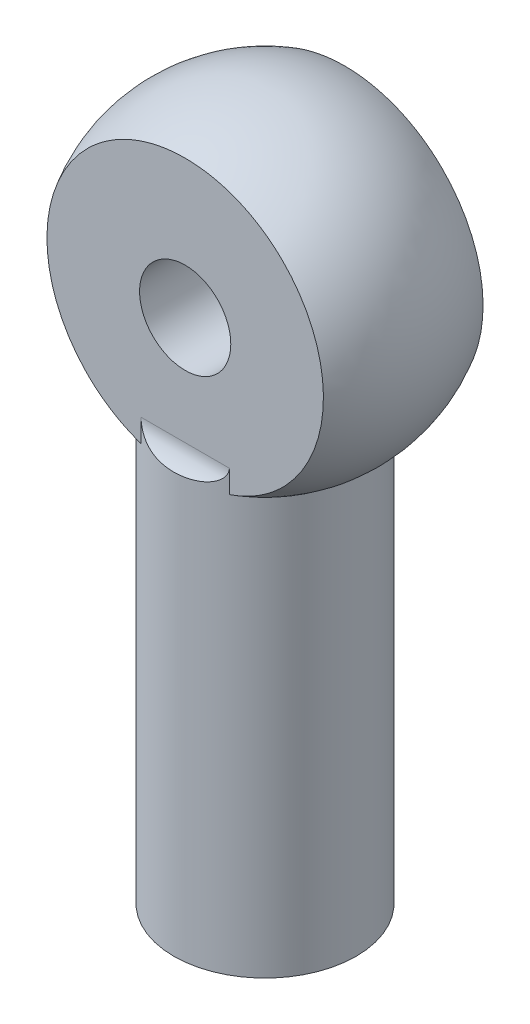
ISO-10303-21;
HEADER;
FILE_DESCRIPTION(('STEP AP214'),'2;1');
FILE_NAME('part.step','',(''),(''),'','','');
FILE_SCHEMA(('AUTOMOTIVE_DESIGN { 1 0 10303 214 1 1 1 1 }'));
ENDSEC;
DATA;
#1=APPLICATION_CONTEXT('core data for automotive mechanical design processes');
#2=APPLICATION_PROTOCOL_DEFINITION('international standard','automotive_design',2000,#1);
#3=PRODUCT_CONTEXT('',#1,'mechanical');
#4=PRODUCT('Part','Part','',(#3));
#5=PRODUCT_RELATED_PRODUCT_CATEGORY('part','',(#4));
#6=PRODUCT_DEFINITION_FORMATION('','',#4);
#7=PRODUCT_DEFINITION_CONTEXT('part definition',#1,'design');
#8=PRODUCT_DEFINITION('design','',#6,#7);
#9=PRODUCT_DEFINITION_SHAPE('','',#8);
#10=(LENGTH_UNIT() NAMED_UNIT(*) SI_UNIT(.MILLI.,.METRE.));
#11=(NAMED_UNIT(*) PLANE_ANGLE_UNIT() SI_UNIT($,.RADIAN.));
#12=(NAMED_UNIT(*) SI_UNIT($,.STERADIAN.) SOLID_ANGLE_UNIT());
#13=UNCERTAINTY_MEASURE_WITH_UNIT(LENGTH_MEASURE(1.E-05),#10,'distance_accuracy_value','');
#14=(GEOMETRIC_REPRESENTATION_CONTEXT(3) GLOBAL_UNCERTAINTY_ASSIGNED_CONTEXT((#13)) GLOBAL_UNIT_ASSIGNED_CONTEXT((#10,
#11,#12)) REPRESENTATION_CONTEXT('',''));
#15=CARTESIAN_POINT('',(0.,0.,0.));
#16=DIRECTION('',(0.,0.,1.));
#17=DIRECTION('',(1.,0.,0.));
#18=AXIS2_PLACEMENT_3D('',#15,#16,#17);
#19=CARTESIAN_POINT('',(4.,7.,0.));
#20=DIRECTION('',(0.,1.,0.));
#21=DIRECTION('',(1.,0.,0.));
#22=AXIS2_PLACEMENT_3D('',#19,#20,#21);
#23=SPHERICAL_SURFACE('',#22,7.);
#24=CARTESIAN_POINT('',(4.,1.25543735346197,0.));
#25=DIRECTION('',(0.,1.,0.));
#26=DIRECTION('',(-1.,0.,0.));
#27=AXIS2_PLACEMENT_3D('',#24,#25,#26);
#28=CIRCLE('',#27,4.);
#29=CARTESIAN_POINT('',(5.93649167310371,1.25543735346197,3.5));
#30=VERTEX_POINT('',#29);
#31=CARTESIAN_POINT('',(5.93649167310371,1.25543735346197,-3.5));
#32=VERTEX_POINT('',#31);
#33=EDGE_CURVE('E85',#30,#32,#28,.T.);
#34=ORIENTED_EDGE('',*,*,#33,.T.);
#35=CARTESIAN_POINT('',(4.,7.,-3.5));
#36=DIRECTION('',(0.,0.,1.));
#37=DIRECTION('',(0.,-1.,0.));
#38=AXIS2_PLACEMENT_3D('',#35,#36,#37);
#39=CIRCLE('',#38,6.06217782649107);
#40=CARTESIAN_POINT('',(2.0635083268963,1.25543735346198,-3.5));
#41=VERTEX_POINT('',#40);
#42=EDGE_CURVE('E88',#32,#41,#39,.T.);
#43=ORIENTED_EDGE('',*,*,#42,.T.);
#44=CARTESIAN_POINT('',(2.06350832689629,1.25543735346197,3.5));
#45=VERTEX_POINT('',#44);
#46=EDGE_CURVE('E87',#41,#45,#28,.T.);
#47=ORIENTED_EDGE('',*,*,#46,.T.);
#48=CARTESIAN_POINT('',(4.,7.,3.5));
#49=DIRECTION('',(0.,0.,1.));
#50=DIRECTION('',(1.,0.,0.));
#51=AXIS2_PLACEMENT_3D('',#48,#49,#50);
#52=CIRCLE('',#51,6.06217782649107);
#53=EDGE_CURVE('E76',#30,#45,#52,.T.);
#54=ORIENTED_EDGE('',*,*,#53,.F.);
#55=EDGE_LOOP('',(#34,#43,#47,#54));
#56=FACE_BOUND('',#55,.T.);
#57=ADVANCED_FACE('F34',(#56),#23,.T.);
#58=CARTESIAN_POINT('',(4.,-17.,0.));
#59=DIRECTION('',(0.,1.,0.));
#60=DIRECTION('',(-1.,0.,0.));
#61=AXIS2_PLACEMENT_3D('',#58,#59,#60);
#62=PLANE('',#61);
#63=CARTESIAN_POINT('',(4.,-17.,0.));
#64=DIRECTION('',(0.,-1.,0.));
#65=DIRECTION('',(1.,0.,0.));
#66=AXIS2_PLACEMENT_3D('',#63,#64,#65);
#67=CIRCLE('',#66,2.);
#68=CARTESIAN_POINT('',(6.,-17.,0.));
#69=VERTEX_POINT('',#68);
#70=EDGE_CURVE('E98',#69,#69,#67,.T.);
#71=ORIENTED_EDGE('',*,*,#70,.F.);
#72=EDGE_LOOP('',(#71));
#73=FACE_BOUND('',#72,.T.);
#74=CARTESIAN_POINT('',(4.,-17.,0.));
#75=DIRECTION('',(0.,1.,0.));
#76=DIRECTION('',(-1.,0.,0.));
#77=AXIS2_PLACEMENT_3D('',#74,#75,#76);
#78=CIRCLE('',#77,4.);
#79=CARTESIAN_POINT('',(0.,-17.,0.));
#80=VERTEX_POINT('',#79);
#81=EDGE_CURVE('E89',#80,#80,#78,.T.);
#82=ORIENTED_EDGE('',*,*,#81,.F.);
#83=EDGE_LOOP('',(#82));
#84=FACE_BOUND('',#83,.T.);
#85=ADVANCED_FACE('F123',(#73,#84),#62,.F.);
#86=CARTESIAN_POINT('',(4.,14.,0.));
#87=DIRECTION('',(0.,1.,0.));
#88=DIRECTION('',(-1.,0.,0.));
#89=AXIS2_PLACEMENT_3D('',#86,#87,#88);
#90=CYLINDRICAL_SURFACE('',#89,4.);
#91=DIRECTION('',(0.,1.,0.));
#92=VECTOR('',#91,1.);
#93=CARTESIAN_POINT('',(5.93649167310371,2.25543735346197,3.5));
#94=LINE('',#93,#92);
#95=CARTESIAN_POINT('',(5.93649167310371,2.25543735346197,3.5));
#96=VERTEX_POINT('',#95);
#97=EDGE_CURVE('E72',#96,#30,#94,.F.);
#98=ORIENTED_EDGE('',*,*,#97,.F.);
#99=CARTESIAN_POINT('',(5.93649167310371,2.25543735346197,3.5));
#100=CARTESIAN_POINT('',(5.93654092379007,2.22673001978082,3.49996308809474));
#101=CARTESIAN_POINT('',(5.93426114811949,2.19808384631559,3.50123433941194));
#102=CARTESIAN_POINT('',(5.92546769204043,2.14186620515227,3.50608276605149));
#103=CARTESIAN_POINT('',(5.91898659720174,2.11428818304731,3.50964219245945));
#104=CARTESIAN_POINT('',(5.90222270849331,2.0607588862967,3.51875445780161));
#105=CARTESIAN_POINT('',(5.89194876163645,2.03480398908894,3.52430265695858));
#106=CARTESIAN_POINT('',(5.86815826211663,1.98480421090087,3.53697167408665));
#107=CARTESIAN_POINT('',(5.85463532556468,1.96076321589978,3.54409558593575));
#108=CARTESIAN_POINT('',(5.81663133467395,1.9020025250381,3.56377905007528));
#109=CARTESIAN_POINT('',(5.79024149415002,1.8687911649137,3.57715642812788));
#110=CARTESIAN_POINT('',(5.73279368401518,1.80741429787041,3.60533778925412));
#111=CARTESIAN_POINT('',(5.70172476702678,1.77926097298326,3.62014508788618));
#112=CARTESIAN_POINT('',(5.61622773237972,1.71163820122258,3.65939143793828));
#113=CARTESIAN_POINT('',(5.55913223508577,1.67577496301329,3.68418390004483));
#114=CARTESIAN_POINT('',(5.43968204801416,1.61317848805314,3.73249413842498));
#115=CARTESIAN_POINT('',(5.37731367454452,1.58646997566955,3.75600832071588));
#116=CARTESIAN_POINT('',(5.25500425778152,1.54214967813796,3.79852268354728));
#117=CARTESIAN_POINT('',(5.19535091383807,1.52393505179368,3.81773869025047));
#118=CARTESIAN_POINT('',(5.07406637120553,1.49204419010563,3.85362006788863));
#119=CARTESIAN_POINT('',(5.01243354790921,1.47837179276231,3.87028327543827));
#120=CARTESIAN_POINT('',(4.88779050244931,1.45463381335752,3.90076225002791));
#121=CARTESIAN_POINT('',(4.82478009919624,1.44456870855361,3.91457764018896));
#122=CARTESIAN_POINT('',(4.69777596569175,1.42735075988373,3.93919998787572));
#123=CARTESIAN_POINT('',(4.6337819794512,1.42019868795892,3.95000614772871));
#124=CARTESIAN_POINT('',(4.47547703912614,1.40555707856756,3.97277351243643));
#125=CARTESIAN_POINT('',(4.3807818529349,1.39943015112528,3.9829731683636));
#126=CARTESIAN_POINT('',(4.19072321561555,1.39135655252623,3.99658709268504));
#127=CARTESIAN_POINT('',(4.09535962247608,1.38941079849438,3.99999987239088));
#128=CARTESIAN_POINT('',(3.91527865229126,1.38941297243523,4.0000001133731));
#129=CARTESIAN_POINT('',(3.83056043873222,1.39095073900751,3.99730653012422));
#130=CARTESIAN_POINT('',(3.66153763197775,1.39729184526725,3.98655441745223));
#131=CARTESIAN_POINT('',(3.57723327061694,1.40209684250715,3.97849316491176));
#132=CARTESIAN_POINT('',(3.40973059172965,1.41554012574654,3.95710749292122));
#133=CARTESIAN_POINT('',(3.32653074931901,1.42417239902565,3.94379133262029));
#134=CARTESIAN_POINT('',(3.161798682963,1.44627868991873,3.91208876559383));
#135=CARTESIAN_POINT('',(3.08026503068009,1.45974835937502,3.89370691567165));
#136=CARTESIAN_POINT('',(2.93930758811119,1.48904646299409,3.85731321684881));
#137=CARTESIAN_POINT('',(2.87934052710437,1.50349876881357,3.84030417892088));
#138=CARTESIAN_POINT('',(2.76140894720826,1.53705904015779,3.80390519518789));
#139=CARTESIAN_POINT('',(2.70344497715103,1.55616827027673,3.78451460337923));
#140=CARTESIAN_POINT('',(2.5900388104125,1.60045555804175,3.74375014780507));
#141=CARTESIAN_POINT('',(2.53461747443718,1.62567580024717,3.72236316285548));
#142=CARTESIAN_POINT('',(2.42826260119203,1.68376767247518,3.67871126447472));
#143=CARTESIAN_POINT('',(2.37732092406123,1.71662501207934,3.65644805446846));
#144=CARTESIAN_POINT('',(2.30104006406909,1.77714671499841,3.62140279755807));
#145=CARTESIAN_POINT('',(2.27347779915933,1.80181902004701,3.60831694728654));
#146=CARTESIAN_POINT('',(2.22186020332497,1.85509709205193,3.5831602513739));
#147=CARTESIAN_POINT('',(2.19780271851163,1.88370042198139,3.57108878428311));
#148=CARTESIAN_POINT('',(2.15766378618163,1.94037658173571,3.55052533930886));
#149=CARTESIAN_POINT('',(2.14092703159089,1.96788332492963,3.54176805772725));
#150=CARTESIAN_POINT('',(2.11178441813949,2.02558897108805,3.52631715158167));
#151=CARTESIAN_POINT('',(2.09936634711768,2.05577997457508,3.519617714324));
#152=CARTESIAN_POINT('',(2.08111265722014,2.11389122725749,3.50969659549748));
#153=CARTESIAN_POINT('',(2.07459727922606,2.14153441808977,3.50611850665981));
#154=CARTESIAN_POINT('',(2.06575369609603,2.19790383777853,3.50124256030533));
#155=CARTESIAN_POINT('',(2.06346038080216,2.22663710594455,3.49996370496699));
#156=CARTESIAN_POINT('',(2.06350832689629,2.25543735346197,3.5));
#157=B_SPLINE_CURVE_WITH_KNOTS('',3,(#99,#100,#101,#102,#103,#104,#105,#106,#107,#108,#109,#110,
#111,#112,#113,#114,#115,#116,#117,#118,#119,#120,#121,#122,#123,#124,#125,#126,#127,#128,#129,
#130,#131,#132,#133,#134,#135,#136,#137,#138,#139,#140,#141,#142,#143,#144,#145,#146,#147,#148,
#149,#150,#151,#152,#153,#154,#155,#156),.UNSPECIFIED.,.F.,.F.,(4,2,2,2,2,2,2,2,2,2,2,2,2,2,2,2,
2,2,2,2,2,2,2,2,2,2,2,2,4),(0.,0.0859063606141315,0.171154274167816,0.256204586377355,
0.341423399340485,0.474096797302446,0.607085569879978,0.821388813207654,1.03626635196854,
1.23178111482224,1.42746066207251,1.62316608886924,1.8189233430716,2.10486886159701,
2.39087709481414,2.64497838364879,2.89920868105781,3.15304098550821,3.4066456981508,
3.59840892986249,3.7902242932823,3.98340350388424,4.17622410988011,4.29365892210202,
4.41102125665095,4.51074884817048,4.61019209708668,4.69566162684801,4.78183433407867),.UNSPECIFIED.);
#158=CARTESIAN_POINT('',(2.06350832689629,2.25543735346197,3.5));
#159=VERTEX_POINT('',#158);
#160=EDGE_CURVE('E80',#96,#159,#157,.T.);
#161=ORIENTED_EDGE('',*,*,#160,.T.);
#162=DIRECTION('',(0.,1.,0.));
#163=VECTOR('',#162,1.);
#164=CARTESIAN_POINT('',(2.06350832689629,1.25543735346197,3.5));
#165=LINE('',#164,#163);
#166=EDGE_CURVE('E102',#45,#159,#165,.T.);
#167=ORIENTED_EDGE('',*,*,#166,.F.);
#168=ORIENTED_EDGE('',*,*,#46,.F.);
#169=DIRECTION('',(0.,1.,0.));
#170=VECTOR('',#169,1.);
#171=CARTESIAN_POINT('',(2.06350832689629,2.25543735346198,-3.5));
#172=LINE('',#171,#170);
#173=CARTESIAN_POINT('',(2.06350832689629,2.25543735346198,-3.5));
#174=VERTEX_POINT('',#173);
#175=EDGE_CURVE('E111',#174,#41,#172,.F.);
#176=ORIENTED_EDGE('',*,*,#175,.F.);
#177=CARTESIAN_POINT('',(2.06350832689629,2.25543735346198,-3.5));
#178=CARTESIAN_POINT('',(2.06345907620994,2.22673001978083,-3.49996308809474));
#179=CARTESIAN_POINT('',(2.06573885188052,2.19808384631559,-3.50123433941195));
#180=CARTESIAN_POINT('',(2.07453230795957,2.14186620515228,-3.50608276605149));
#181=CARTESIAN_POINT('',(2.08101340279827,2.11428818304732,-3.50964219245946));
#182=CARTESIAN_POINT('',(2.09777729150669,2.06075888629671,-3.51875445780161));
#183=CARTESIAN_POINT('',(2.10805123836355,2.03480398908895,-3.52430265695858));
#184=CARTESIAN_POINT('',(2.13184173788338,1.98480421090088,-3.53697167408666));
#185=CARTESIAN_POINT('',(2.14536467443532,1.96076321589978,-3.54409558593576));
#186=CARTESIAN_POINT('',(2.18336866532606,1.90200252503811,-3.56377905007528));
#187=CARTESIAN_POINT('',(2.20975850584999,1.86879116491371,-3.57715642812788));
#188=CARTESIAN_POINT('',(2.26720631598483,1.80741429787042,-3.60533778925412));
#189=CARTESIAN_POINT('',(2.29827523297322,1.77926097298327,-3.62014508788618));
#190=CARTESIAN_POINT('',(2.38377226762029,1.71163820122259,-3.65939143793828));
#191=CARTESIAN_POINT('',(2.44086776491424,1.6757749630133,-3.68418390004483));
#192=CARTESIAN_POINT('',(2.56031795198585,1.61317848805315,-3.73249413842498));
#193=CARTESIAN_POINT('',(2.62268632545549,1.58646997566956,-3.75600832071589));
#194=CARTESIAN_POINT('',(2.74499574221849,1.54214967813797,-3.79852268354728));
#195=CARTESIAN_POINT('',(2.80464908616194,1.52393505179369,-3.81773869025047));
#196=CARTESIAN_POINT('',(2.92593362879448,1.49204419010564,-3.85362006788864));
#197=CARTESIAN_POINT('',(2.9875664520908,1.47837179276232,-3.87028327543827));
#198=CARTESIAN_POINT('',(3.1122094975507,1.45463381335753,-3.90076225002791));
#199=CARTESIAN_POINT('',(3.17521990080377,1.44456870855361,-3.91457764018896));
#200=CARTESIAN_POINT('',(3.30222403430826,1.42735075988374,-3.93919998787572));
#201=CARTESIAN_POINT('',(3.36621802054881,1.42019868795893,-3.95000614772871));
#202=CARTESIAN_POINT('',(3.52452296087387,1.40555707856757,-3.97277351243643));
#203=CARTESIAN_POINT('',(3.61921814706511,1.39943015112529,-3.9829731683636));
#204=CARTESIAN_POINT('',(3.80927678438445,1.39135655252624,-3.99658709268504));
#205=CARTESIAN_POINT('',(3.90464037752393,1.38941079849439,-3.99999987239088));
#206=CARTESIAN_POINT('',(4.08472134770874,1.38941297243524,-4.0000001133731));
#207=CARTESIAN_POINT('',(4.16943956126778,1.39095073900752,-3.99730653012422));
#208=CARTESIAN_POINT('',(4.33846236802225,1.39729184526726,-3.98655441745223));
#209=CARTESIAN_POINT('',(4.42276672938306,1.40209684250716,-3.97849316491176));
#210=CARTESIAN_POINT('',(4.59026940827035,1.41554012574655,-3.95710749292122));
#211=CARTESIAN_POINT('',(4.67346925068099,1.42417239902566,-3.94379133262029));
#212=CARTESIAN_POINT('',(4.838201317037,1.44627868991874,-3.91208876559383));
#213=CARTESIAN_POINT('',(4.91973496931991,1.45974835937503,-3.89370691567165));
#214=CARTESIAN_POINT('',(5.06069241188881,1.4890464629941,-3.85731321684881));
#215=CARTESIAN_POINT('',(5.12065947289563,1.50349876881358,-3.84030417892088));
#216=CARTESIAN_POINT('',(5.23859105279174,1.5370590401578,-3.80390519518789));
#217=CARTESIAN_POINT('',(5.29655502284897,1.55616827027674,-3.78451460337923));
#218=CARTESIAN_POINT('',(5.40996118958749,1.60045555804176,-3.74375014780508));
#219=CARTESIAN_POINT('',(5.46538252556281,1.62567580024718,-3.72236316285548));
#220=CARTESIAN_POINT('',(5.57173739880796,1.68376767247519,-3.67871126447473));
#221=CARTESIAN_POINT('',(5.62267907593876,1.71662501207935,-3.65644805446846));
#222=CARTESIAN_POINT('',(5.6989599359309,1.77714671499841,-3.62140279755807));
#223=CARTESIAN_POINT('',(5.72652220084066,1.80181902004702,-3.60831694728654));
#224=CARTESIAN_POINT('',(5.77813979667503,1.85509709205194,-3.5831602513739));
#225=CARTESIAN_POINT('',(5.80219728148836,1.88370042198139,-3.57108878428311));
#226=CARTESIAN_POINT('',(5.84233621381837,1.94037658173572,-3.55052533930886));
#227=CARTESIAN_POINT('',(5.8590729684091,1.96788332492963,-3.54176805772725));
#228=CARTESIAN_POINT('',(5.88821558186051,2.02558897108806,-3.52631715158168));
#229=CARTESIAN_POINT('',(5.90063365288232,2.05577997457508,-3.519617714324));
#230=CARTESIAN_POINT('',(5.91888734277985,2.1138912272575,-3.50969659549749));
#231=CARTESIAN_POINT('',(5.92540272077393,2.14153441808977,-3.50611850665981));
#232=CARTESIAN_POINT('',(5.93424630390397,2.19790383777854,-3.50124256030533));
#233=CARTESIAN_POINT('',(5.93653961919784,2.22663710594456,-3.49996370496699));
#234=CARTESIAN_POINT('',(5.93649167310371,2.25543735346198,-3.5));
#235=B_SPLINE_CURVE_WITH_KNOTS('',3,(#177,#178,#179,#180,#181,#182,#183,#184,#185,#186,#187,
#188,#189,#190,#191,#192,#193,#194,#195,#196,#197,#198,#199,#200,#201,#202,#203,#204,#205,#206,
#207,#208,#209,#210,#211,#212,#213,#214,#215,#216,#217,#218,#219,#220,#221,#222,#223,#224,#225,
#226,#227,#228,#229,#230,#231,#232,#233,#234),.UNSPECIFIED.,.F.,.F.,(4,2,2,2,2,2,2,2,2,2,2,2,2,
2,2,2,2,2,2,2,2,2,2,2,2,2,2,2,4),(0.,0.0859063606141315,0.171154274167816,0.256204586377355,
0.341423399340485,0.474096797302446,0.607085569879978,0.821388813207654,1.03626635196854,
1.23178111482224,1.42746066207251,1.62316608886923,1.8189233430716,2.10486886159701,
2.39087709481413,2.64497838364878,2.8992086810578,3.1530409855082,3.40664569815079,
3.59840892986248,3.79022429328229,3.98340350388422,4.1762241098801,4.293658922102,
4.41102125665093,4.51074884817047,4.61019209708666,4.695661626848,4.78183433407866),.UNSPECIFIED.);
#236=CARTESIAN_POINT('',(5.93649167310371,2.25543735346198,-3.5));
#237=VERTEX_POINT('',#236);
#238=EDGE_CURVE('E11',#174,#237,#235,.T.);
#239=ORIENTED_EDGE('',*,*,#238,.T.);
#240=DIRECTION('',(0.,1.,0.));
#241=VECTOR('',#240,1.);
#242=CARTESIAN_POINT('',(5.93649167310371,1.25543735346197,-3.5));
#243=LINE('',#242,#241);
#244=EDGE_CURVE('E45',#32,#237,#243,.T.);
#245=ORIENTED_EDGE('',*,*,#244,.F.);
#246=ORIENTED_EDGE('',*,*,#33,.F.);
#247=EDGE_LOOP('',(#98,#161,#167,#168,#176,#239,#245,#246));
#248=FACE_BOUND('',#247,.T.);
#249=ORIENTED_EDGE('',*,*,#81,.T.);
#250=EDGE_LOOP('',(#249));
#251=FACE_BOUND('',#250,.T.);
#252=ADVANCED_FACE('F91',(#248,#251),#90,.T.);
#253=CARTESIAN_POINT('',(4.,0.,0.));
#254=DIRECTION('',(0.,-1.,0.));
#255=DIRECTION('',(1.,0.,0.));
#256=AXIS2_PLACEMENT_3D('',#253,#254,#255);
#257=CYLINDRICAL_SURFACE('',#256,2.);
#258=CARTESIAN_POINT('',(4.,0.,0.));
#259=DIRECTION('',(0.,-1.,0.));
#260=DIRECTION('',(1.,0.,0.));
#261=AXIS2_PLACEMENT_3D('',#258,#259,#260);
#262=CIRCLE('',#261,2.);
#263=CARTESIAN_POINT('',(6.,0.,0.));
#264=VERTEX_POINT('',#263);
#265=EDGE_CURVE('E96',#264,#264,#262,.T.);
#266=ORIENTED_EDGE('',*,*,#265,.F.);
#267=EDGE_LOOP('',(#266));
#268=FACE_BOUND('',#267,.T.);
#269=ORIENTED_EDGE('',*,*,#70,.T.);
#270=EDGE_LOOP('',(#269));
#271=FACE_BOUND('',#270,.T.);
#272=ADVANCED_FACE('F129',(#268,#271),#257,.F.);
#273=CARTESIAN_POINT('',(4.,0.,0.));
#274=DIRECTION('',(0.,-1.,0.));
#275=DIRECTION('',(1.,0.,0.));
#276=AXIS2_PLACEMENT_3D('',#273,#274,#275);
#277=PLANE('',#276);
#278=ORIENTED_EDGE('',*,*,#265,.T.);
#279=EDGE_LOOP('',(#278));
#280=FACE_BOUND('',#279,.T.);
#281=ADVANCED_FACE('F148',(#280),#277,.T.);
#282=CARTESIAN_POINT('',(-5.,0.,3.5));
#283=DIRECTION('',(0.,0.,1.));
#284=DIRECTION('',(1.,0.,0.));
#285=AXIS2_PLACEMENT_3D('',#282,#283,#284);
#286=PLANE('',#285);
#287=CARTESIAN_POINT('',(4.,7.,3.5));
#288=DIRECTION('',(0.,0.,1.));
#289=DIRECTION('',(1.,0.,0.));
#290=AXIS2_PLACEMENT_3D('',#287,#288,#289);
#291=CIRCLE('',#290,2.);
#292=CARTESIAN_POINT('',(6.,7.,3.5));
#293=VERTEX_POINT('',#292);
#294=EDGE_CURVE('E137',#293,#293,#291,.T.);
#295=ORIENTED_EDGE('',*,*,#294,.F.);
#296=EDGE_LOOP('',(#295));
#297=FACE_BOUND('',#296,.T.);
#298=DIRECTION('',(1.,0.,0.));
#299=VECTOR('',#298,1.);
#300=CARTESIAN_POINT('',(5.93649167310371,2.25543735346197,3.5));
#301=LINE('',#300,#299);
#302=EDGE_CURVE('E79',#159,#96,#301,.T.);
#303=ORIENTED_EDGE('',*,*,#302,.T.);
#304=ORIENTED_EDGE('',*,*,#97,.T.);
#305=ORIENTED_EDGE('',*,*,#53,.T.);
#306=ORIENTED_EDGE('',*,*,#166,.T.);
#307=EDGE_LOOP('',(#303,#304,#305,#306));
#308=FACE_BOUND('',#307,.T.);
#309=ADVANCED_FACE('F74',(#297,#308),#286,.T.);
#310=CARTESIAN_POINT('',(-5.,0.,-3.5));
#311=DIRECTION('',(0.,0.,1.));
#312=DIRECTION('',(0.,-1.,0.));
#313=AXIS2_PLACEMENT_3D('',#310,#311,#312);
#314=PLANE('',#313);
#315=CARTESIAN_POINT('',(4.,7.,-3.5));
#316=DIRECTION('',(0.,0.,1.));
#317=DIRECTION('',(0.,-1.,0.));
#318=AXIS2_PLACEMENT_3D('',#315,#316,#317);
#319=CIRCLE('',#318,2.);
#320=CARTESIAN_POINT('',(4.,5.,-3.5));
#321=VERTEX_POINT('',#320);
#322=EDGE_CURVE('E39',#321,#321,#319,.T.);
#323=ORIENTED_EDGE('',*,*,#322,.T.);
#324=EDGE_LOOP('',(#323));
#325=FACE_BOUND('',#324,.T.);
#326=ORIENTED_EDGE('',*,*,#42,.F.);
#327=ORIENTED_EDGE('',*,*,#244,.T.);
#328=DIRECTION('',(1.,0.,0.));
#329=VECTOR('',#328,1.);
#330=CARTESIAN_POINT('',(2.0635083268963,2.25543735346198,-3.5));
#331=LINE('',#330,#329);
#332=EDGE_CURVE('E225',#237,#174,#331,.F.);
#333=ORIENTED_EDGE('',*,*,#332,.T.);
#334=ORIENTED_EDGE('',*,*,#175,.T.);
#335=EDGE_LOOP('',(#326,#327,#333,#334));
#336=FACE_BOUND('',#335,.T.);
#337=ADVANCED_FACE('F120',(#325,#336),#314,.F.);
#338=CARTESIAN_POINT('',(-5.,2.25543735346197,4.5));
#339=DIRECTION('',(-1.,0.,0.));
#340=DIRECTION('',(0.,0.,1.));
#341=AXIS2_PLACEMENT_3D('',#338,#339,#340);
#342=CYLINDRICAL_SURFACE('',#341,1.);
#343=ORIENTED_EDGE('',*,*,#302,.F.);
#344=ORIENTED_EDGE('',*,*,#160,.F.);
#345=EDGE_LOOP('',(#343,#344));
#346=FACE_BOUND('',#345,.T.);
#347=ADVANCED_FACE('F116',(#346),#342,.F.);
#348=CARTESIAN_POINT('',(-5.,2.25543735346198,-4.5));
#349=DIRECTION('',(-1.,0.,0.));
#350=DIRECTION('',(0.,0.,1.));
#351=AXIS2_PLACEMENT_3D('',#348,#349,#350);
#352=CYLINDRICAL_SURFACE('',#351,1.);
#353=ORIENTED_EDGE('',*,*,#238,.F.);
#354=ORIENTED_EDGE('',*,*,#332,.F.);
#355=EDGE_LOOP('',(#353,#354));
#356=FACE_BOUND('',#355,.T.);
#357=ADVANCED_FACE('F36',(#356),#352,.F.);
#358=CARTESIAN_POINT('',(4.,7.,-4.));
#359=DIRECTION('',(0.,0.,1.));
#360=DIRECTION('',(1.,0.,0.));
#361=AXIS2_PLACEMENT_3D('',#358,#359,#360);
#362=CYLINDRICAL_SURFACE('',#361,2.);
#363=ORIENTED_EDGE('',*,*,#294,.T.);
#364=EDGE_LOOP('',(#363));
#365=FACE_BOUND('',#364,.T.);
#366=ORIENTED_EDGE('',*,*,#322,.F.);
#367=EDGE_LOOP('',(#366));
#368=FACE_BOUND('',#367,.T.);
#369=ADVANCED_FACE('F144',(#365,#368),#362,.F.);
#370=CLOSED_SHELL('',(#57,#85,#252,#272,#281,#309,#337,#347,#357,#369));
#371=MANIFOLD_SOLID_BREP('B2',#370);
#372=ADVANCED_BREP_SHAPE_REPRESENTATION('',(#18,#371),#14);
#373=SHAPE_DEFINITION_REPRESENTATION(#9,#372);
ENDSEC;
END-ISO-10303-21;
